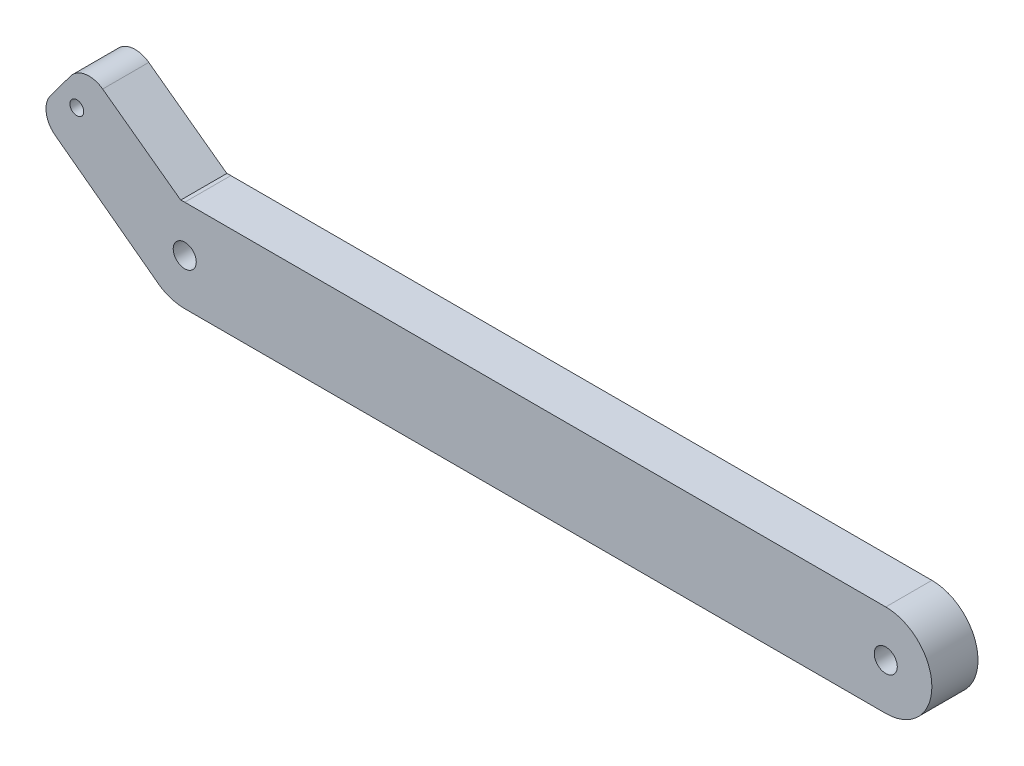
ISO-10303-21;
HEADER;
FILE_DESCRIPTION(('STEP AP214'),'2;1');
FILE_NAME('part.step','',(''),(''),'','','');
FILE_SCHEMA(('AUTOMOTIVE_DESIGN { 1 0 10303 214 1 1 1 1 }'));
ENDSEC;
DATA;
#1=APPLICATION_CONTEXT('core data for automotive mechanical design processes');
#2=APPLICATION_PROTOCOL_DEFINITION('international standard','automotive_design',2000,#1);
#3=PRODUCT_CONTEXT('',#1,'mechanical');
#4=PRODUCT('Part','Part','',(#3));
#5=PRODUCT_RELATED_PRODUCT_CATEGORY('part','',(#4));
#6=PRODUCT_DEFINITION_FORMATION('','',#4);
#7=PRODUCT_DEFINITION_CONTEXT('part definition',#1,'design');
#8=PRODUCT_DEFINITION('design','',#6,#7);
#9=PRODUCT_DEFINITION_SHAPE('','',#8);
#10=(LENGTH_UNIT() NAMED_UNIT(*) SI_UNIT(.MILLI.,.METRE.));
#11=(NAMED_UNIT(*) PLANE_ANGLE_UNIT() SI_UNIT($,.RADIAN.));
#12=(NAMED_UNIT(*) SI_UNIT($,.STERADIAN.) SOLID_ANGLE_UNIT());
#13=UNCERTAINTY_MEASURE_WITH_UNIT(LENGTH_MEASURE(1.E-05),#10,'distance_accuracy_value','');
#14=(GEOMETRIC_REPRESENTATION_CONTEXT(3) GLOBAL_UNCERTAINTY_ASSIGNED_CONTEXT((#13)) GLOBAL_UNIT_ASSIGNED_CONTEXT((#10,
#11,#12)) REPRESENTATION_CONTEXT('',''));
#15=CARTESIAN_POINT('',(0.,0.,0.));
#16=DIRECTION('',(0.,0.,1.));
#17=DIRECTION('',(1.,0.,0.));
#18=AXIS2_PLACEMENT_3D('',#15,#16,#17);
#19=CARTESIAN_POINT('',(0.,10.0000000000007,10.));
#20=DIRECTION('',(0.,0.,-1.));
#21=DIRECTION('',(-1.,0.,0.));
#22=AXIS2_PLACEMENT_3D('',#19,#20,#21);
#23=PLANE('',#22);
#24=CARTESIAN_POINT('',(0.,10.0000000000007,10.));
#25=DIRECTION('',(0.,0.,1.));
#26=DIRECTION('',(-1.,0.,0.));
#27=AXIS2_PLACEMENT_3D('',#24,#25,#26);
#28=CIRCLE('',#27,10.0000000000007);
#29=CARTESIAN_POINT('',(-5.30568368334004,1.52357854679586,10.));
#30=VERTEX_POINT('',#29);
#31=CARTESIAN_POINT('',(0.,0.,10.));
#32=VERTEX_POINT('',#31);
#33=EDGE_CURVE('E161',#30,#32,#28,.T.);
#34=ORIENTED_EDGE('',*,*,#33,.T.);
#35=DIRECTION('',(1.,0.,0.));
#36=VECTOR('',#35,1.);
#37=CARTESIAN_POINT('',(0.,0.,10.));
#38=LINE('',#37,#36);
#39=CARTESIAN_POINT('',(152.,0.,10.));
#40=VERTEX_POINT('',#39);
#41=EDGE_CURVE('E99',#32,#40,#38,.T.);
#42=ORIENTED_EDGE('',*,*,#41,.T.);
#43=CARTESIAN_POINT('',(152.,10.,10.));
#44=DIRECTION('',(0.,0.,1.));
#45=DIRECTION('',(-1.,0.,0.));
#46=AXIS2_PLACEMENT_3D('',#43,#44,#45);
#47=CIRCLE('',#46,10.);
#48=CARTESIAN_POINT('',(152.,20.,10.));
#49=VERTEX_POINT('',#48);
#50=EDGE_CURVE('E182',#40,#49,#47,.T.);
#51=ORIENTED_EDGE('',*,*,#50,.T.);
#52=DIRECTION('',(-1.,0.,0.));
#53=VECTOR('',#52,1.);
#54=CARTESIAN_POINT('',(0.,20.,10.));
#55=LINE('',#54,#53);
#56=CARTESIAN_POINT('',(0.,20.,10.));
#57=VERTEX_POINT('',#56);
#58=EDGE_CURVE('E201',#49,#57,#55,.T.);
#59=ORIENTED_EDGE('',*,*,#58,.T.);
#60=CARTESIAN_POINT('',(0.,10.0000000000007,10.));
#61=DIRECTION('',(0.,0.,1.));
#62=DIRECTION('',(1.,0.,0.));
#63=AXIS2_PLACEMENT_3D('',#60,#61,#62);
#64=CIRCLE('',#63,9.99999999999928);
#65=CARTESIAN_POINT('',(-0.876599726412103,19.961504551003,10.));
#66=VERTEX_POINT('',#65);
#67=EDGE_CURVE('E198',#57,#66,#64,.T.);
#68=ORIENTED_EDGE('',*,*,#67,.T.);
#69=DIRECTION('',(-0.806856744966036,0.590747148196936,0.));
#70=VECTOR('',#69,1.);
#71=CARTESIAN_POINT('',(-17.7993268257786,32.3516256425564,10.));
#72=LINE('',#71,#70);
#73=CARTESIAN_POINT('',(-17.7993268257786,32.3516256425564,10.));
#74=VERTEX_POINT('',#73);
#75=EDGE_CURVE('E200',#66,#74,#72,.T.);
#76=ORIENTED_EDGE('',*,*,#75,.T.);
#77=CARTESIAN_POINT('',(-20.7530625667633,28.3173419177262,10.));
#78=DIRECTION('',(0.,0.,1.));
#79=DIRECTION('',(1.,0.,0.));
#80=AXIS2_PLACEMENT_3D('',#77,#78,#79);
#81=CIRCLE('',#80,5.);
#82=CARTESIAN_POINT('',(-24.7625453028706,31.3046564624064,10.));
#83=VERTEX_POINT('',#82);
#84=EDGE_CURVE('E124',#74,#83,#81,.T.);
#85=ORIENTED_EDGE('',*,*,#84,.T.);
#86=DIRECTION('',(-0.59746290893604,-0.801896547221452,0.));
#87=VECTOR('',#86,1.);
#88=CARTESIAN_POINT('',(-29.098088918838,25.4856216671527,10.));
#89=LINE('',#88,#87);
#90=CARTESIAN_POINT('',(-29.098088918838,25.4856216671527,10.));
#91=VERTEX_POINT('',#90);
#92=EDGE_CURVE('E118',#83,#91,#89,.T.);
#93=ORIENTED_EDGE('',*,*,#92,.T.);
#94=CARTESIAN_POINT('',(-25.0886061827308,22.4983071224725,10.));
#95=DIRECTION('',(0.,0.,1.));
#96=DIRECTION('',(1.,0.,0.));
#97=AXIS2_PLACEMENT_3D('',#94,#95,#96);
#98=CIRCLE('',#97,5.);
#99=CARTESIAN_POINT('',(-28.075920727411,18.4888243863652,10.));
#100=VERTEX_POINT('',#99);
#101=EDGE_CURVE('E122',#91,#100,#98,.T.);
#102=ORIENTED_EDGE('',*,*,#101,.T.);
#103=DIRECTION('',(0.801896547221452,-0.59746290893604,0.));
#104=VECTOR('',#103,1.);
#105=CARTESIAN_POINT('',(-5.30568368334004,1.52357854679586,10.));
#106=LINE('',#105,#104);
#107=EDGE_CURVE('E50',#100,#30,#106,.T.);
#108=ORIENTED_EDGE('',*,*,#107,.T.);
#109=EDGE_LOOP('',(#34,#42,#51,#59,#68,#76,#85,#93,#102,#108));
#110=FACE_BOUND('',#109,.T.);
#111=CARTESIAN_POINT('',(0.,10.0000000000007,10.));
#112=DIRECTION('',(0.,0.,1.));
#113=DIRECTION('',(1.,0.,0.));
#114=AXIS2_PLACEMENT_3D('',#111,#112,#113);
#115=CIRCLE('',#114,2.49999999999979);
#116=CARTESIAN_POINT('',(2.49999999999979,10.0000000000007,10.));
#117=VERTEX_POINT('',#116);
#118=EDGE_CURVE('E146',#117,#117,#115,.T.);
#119=ORIENTED_EDGE('',*,*,#118,.F.);
#120=EDGE_LOOP('',(#119));
#121=FACE_BOUND('',#120,.T.);
#122=CARTESIAN_POINT('',(152.,10.,10.));
#123=DIRECTION('',(0.,0.,1.));
#124=DIRECTION('',(1.,0.,0.));
#125=AXIS2_PLACEMENT_3D('',#122,#123,#124);
#126=CIRCLE('',#125,2.5);
#127=CARTESIAN_POINT('',(154.5,10.,10.));
#128=VERTEX_POINT('',#127);
#129=EDGE_CURVE('E212',#128,#128,#126,.T.);
#130=ORIENTED_EDGE('',*,*,#129,.F.);
#131=EDGE_LOOP('',(#130));
#132=FACE_BOUND('',#131,.T.);
#133=CARTESIAN_POINT('',(-23.4097551919063,26.035431675397,10.));
#134=DIRECTION('',(0.,0.,1.));
#135=DIRECTION('',(1.,0.,0.));
#136=AXIS2_PLACEMENT_3D('',#133,#134,#135);
#137=CIRCLE('',#136,1.5);
#138=CARTESIAN_POINT('',(-21.9097551919063,26.035431675397,10.));
#139=VERTEX_POINT('',#138);
#140=EDGE_CURVE('E218',#139,#139,#137,.T.);
#141=ORIENTED_EDGE('',*,*,#140,.F.);
#142=EDGE_LOOP('',(#141));
#143=FACE_BOUND('',#142,.T.);
#144=ADVANCED_FACE('F33',(#110,#121,#132,#143),#23,.F.);
#145=CARTESIAN_POINT('',(0.,10.0000000000007,0.));
#146=DIRECTION('',(0.,0.,-1.));
#147=DIRECTION('',(-1.,0.,0.));
#148=AXIS2_PLACEMENT_3D('',#145,#146,#147);
#149=PLANE('',#148);
#150=CARTESIAN_POINT('',(152.,10.,0.));
#151=DIRECTION('',(0.,0.,1.));
#152=DIRECTION('',(1.,0.,0.));
#153=AXIS2_PLACEMENT_3D('',#150,#151,#152);
#154=CIRCLE('',#153,2.5);
#155=CARTESIAN_POINT('',(154.5,10.,0.));
#156=VERTEX_POINT('',#155);
#157=EDGE_CURVE('E215',#156,#156,#154,.T.);
#158=ORIENTED_EDGE('',*,*,#157,.T.);
#159=EDGE_LOOP('',(#158));
#160=FACE_BOUND('',#159,.T.);
#161=CARTESIAN_POINT('',(0.,10.0000000000007,0.));
#162=DIRECTION('',(0.,0.,1.));
#163=DIRECTION('',(-1.,0.,0.));
#164=AXIS2_PLACEMENT_3D('',#161,#162,#163);
#165=CIRCLE('',#164,10.0000000000007);
#166=CARTESIAN_POINT('',(-5.30568368334004,1.52357854679586,0.));
#167=VERTEX_POINT('',#166);
#168=CARTESIAN_POINT('',(0.,0.,0.));
#169=VERTEX_POINT('',#168);
#170=EDGE_CURVE('E142',#167,#169,#165,.T.);
#171=ORIENTED_EDGE('',*,*,#170,.F.);
#172=DIRECTION('',(0.801896547221452,-0.59746290893604,0.));
#173=VECTOR('',#172,1.);
#174=CARTESIAN_POINT('',(-5.30568368334004,1.52357854679586,0.));
#175=LINE('',#174,#173);
#176=CARTESIAN_POINT('',(-28.075920727411,18.4888243863652,0.));
#177=VERTEX_POINT('',#176);
#178=EDGE_CURVE('E91',#177,#167,#175,.T.);
#179=ORIENTED_EDGE('',*,*,#178,.F.);
#180=CARTESIAN_POINT('',(-25.0886061827308,22.4983071224725,0.));
#181=DIRECTION('',(0.,0.,1.));
#182=DIRECTION('',(1.,0.,0.));
#183=AXIS2_PLACEMENT_3D('',#180,#181,#182);
#184=CIRCLE('',#183,5.);
#185=CARTESIAN_POINT('',(-29.098088918838,25.4856216671527,0.));
#186=VERTEX_POINT('',#185);
#187=EDGE_CURVE('E85',#186,#177,#184,.T.);
#188=ORIENTED_EDGE('',*,*,#187,.F.);
#189=DIRECTION('',(-0.59746290893604,-0.801896547221452,0.));
#190=VECTOR('',#189,1.);
#191=CARTESIAN_POINT('',(-29.098088918838,25.4856216671527,0.));
#192=LINE('',#191,#190);
#193=CARTESIAN_POINT('',(-24.7625453028706,31.3046564624064,0.));
#194=VERTEX_POINT('',#193);
#195=EDGE_CURVE('E132',#194,#186,#192,.T.);
#196=ORIENTED_EDGE('',*,*,#195,.F.);
#197=CARTESIAN_POINT('',(-20.7530625667633,28.3173419177262,0.));
#198=DIRECTION('',(0.,0.,1.));
#199=DIRECTION('',(1.,0.,0.));
#200=AXIS2_PLACEMENT_3D('',#197,#198,#199);
#201=CIRCLE('',#200,5.);
#202=CARTESIAN_POINT('',(-17.7993268257786,32.3516256425564,0.));
#203=VERTEX_POINT('',#202);
#204=EDGE_CURVE('E156',#203,#194,#201,.T.);
#205=ORIENTED_EDGE('',*,*,#204,.F.);
#206=DIRECTION('',(-0.806856744966036,0.590747148196936,0.));
#207=VECTOR('',#206,1.);
#208=CARTESIAN_POINT('',(-17.7993268257786,32.3516256425564,0.));
#209=LINE('',#208,#207);
#210=CARTESIAN_POINT('',(-0.876599726412103,19.961504551003,0.));
#211=VERTEX_POINT('',#210);
#212=EDGE_CURVE('E154',#211,#203,#209,.T.);
#213=ORIENTED_EDGE('',*,*,#212,.F.);
#214=CARTESIAN_POINT('',(0.,10.0000000000007,0.));
#215=DIRECTION('',(0.,0.,1.));
#216=DIRECTION('',(1.,0.,0.));
#217=AXIS2_PLACEMENT_3D('',#214,#215,#216);
#218=CIRCLE('',#217,9.99999999999928);
#219=CARTESIAN_POINT('',(0.,20.,0.));
#220=VERTEX_POINT('',#219);
#221=EDGE_CURVE('E152',#220,#211,#218,.T.);
#222=ORIENTED_EDGE('',*,*,#221,.F.);
#223=DIRECTION('',(-1.,0.,0.));
#224=VECTOR('',#223,1.);
#225=CARTESIAN_POINT('',(0.,20.,0.));
#226=LINE('',#225,#224);
#227=CARTESIAN_POINT('',(152.,20.,0.));
#228=VERTEX_POINT('',#227);
#229=EDGE_CURVE('E150',#228,#220,#226,.T.);
#230=ORIENTED_EDGE('',*,*,#229,.F.);
#231=CARTESIAN_POINT('',(152.,10.,0.));
#232=DIRECTION('',(0.,0.,1.));
#233=DIRECTION('',(-1.,0.,0.));
#234=AXIS2_PLACEMENT_3D('',#231,#232,#233);
#235=CIRCLE('',#234,10.);
#236=CARTESIAN_POINT('',(152.,0.,0.));
#237=VERTEX_POINT('',#236);
#238=EDGE_CURVE('E148',#237,#228,#235,.T.);
#239=ORIENTED_EDGE('',*,*,#238,.F.);
#240=DIRECTION('',(1.,0.,0.));
#241=VECTOR('',#240,1.);
#242=CARTESIAN_POINT('',(0.,0.,0.));
#243=LINE('',#242,#241);
#244=EDGE_CURVE('E145',#169,#237,#243,.T.);
#245=ORIENTED_EDGE('',*,*,#244,.F.);
#246=EDGE_LOOP('',(#171,#179,#188,#196,#205,#213,#222,#230,#239,#245));
#247=FACE_BOUND('',#246,.T.);
#248=CARTESIAN_POINT('',(0.,10.0000000000007,0.));
#249=DIRECTION('',(0.,0.,1.));
#250=DIRECTION('',(1.,0.,0.));
#251=AXIS2_PLACEMENT_3D('',#248,#249,#250);
#252=CIRCLE('',#251,2.49999999999979);
#253=CARTESIAN_POINT('',(2.49999999999979,10.0000000000007,0.));
#254=VERTEX_POINT('',#253);
#255=EDGE_CURVE('E209',#254,#254,#252,.T.);
#256=ORIENTED_EDGE('',*,*,#255,.T.);
#257=EDGE_LOOP('',(#256));
#258=FACE_BOUND('',#257,.T.);
#259=CARTESIAN_POINT('',(-23.4097551919063,26.035431675397,0.));
#260=DIRECTION('',(0.,0.,1.));
#261=DIRECTION('',(1.,0.,0.));
#262=AXIS2_PLACEMENT_3D('',#259,#260,#261);
#263=CIRCLE('',#262,1.5);
#264=CARTESIAN_POINT('',(-21.9097551919063,26.035431675397,0.));
#265=VERTEX_POINT('',#264);
#266=EDGE_CURVE('E221',#265,#265,#263,.T.);
#267=ORIENTED_EDGE('',*,*,#266,.T.);
#268=EDGE_LOOP('',(#267));
#269=FACE_BOUND('',#268,.T.);
#270=ADVANCED_FACE('F186',(#160,#247,#258,#269),#149,.T.);
#271=CARTESIAN_POINT('',(0.,10.0000000000007,10.));
#272=DIRECTION('',(0.,0.,-1.));
#273=DIRECTION('',(-1.,0.,0.));
#274=AXIS2_PLACEMENT_3D('',#271,#272,#273);
#275=CYLINDRICAL_SURFACE('',#274,10.0000000000007);
#276=ORIENTED_EDGE('',*,*,#170,.T.);
#277=DIRECTION('',(0.,0.,-1.));
#278=VECTOR('',#277,1.);
#279=CARTESIAN_POINT('',(0.,0.,10.));
#280=LINE('',#279,#278);
#281=EDGE_CURVE('E11',#32,#169,#280,.T.);
#282=ORIENTED_EDGE('',*,*,#281,.F.);
#283=ORIENTED_EDGE('',*,*,#33,.F.);
#284=DIRECTION('',(0.,0.,-1.));
#285=VECTOR('',#284,1.);
#286=CARTESIAN_POINT('',(-5.30568368334004,1.52357854679586,10.));
#287=LINE('',#286,#285);
#288=EDGE_CURVE('E138',#30,#167,#287,.T.);
#289=ORIENTED_EDGE('',*,*,#288,.T.);
#290=EDGE_LOOP('',(#276,#282,#283,#289));
#291=FACE_BOUND('',#290,.T.);
#292=ADVANCED_FACE('F35',(#291),#275,.T.);
#293=CARTESIAN_POINT('',(0.,0.,10.));
#294=DIRECTION('',(0.,1.,0.));
#295=DIRECTION('',(0.,0.,1.));
#296=AXIS2_PLACEMENT_3D('',#293,#294,#295);
#297=PLANE('',#296);
#298=ORIENTED_EDGE('',*,*,#244,.T.);
#299=DIRECTION('',(0.,0.,-1.));
#300=VECTOR('',#299,1.);
#301=CARTESIAN_POINT('',(152.,0.,10.));
#302=LINE('',#301,#300);
#303=EDGE_CURVE('E42',#40,#237,#302,.T.);
#304=ORIENTED_EDGE('',*,*,#303,.F.);
#305=ORIENTED_EDGE('',*,*,#41,.F.);
#306=ORIENTED_EDGE('',*,*,#281,.T.);
#307=EDGE_LOOP('',(#298,#304,#305,#306));
#308=FACE_BOUND('',#307,.T.);
#309=ADVANCED_FACE('F261',(#308),#297,.F.);
#310=CARTESIAN_POINT('',(152.,10.,10.));
#311=DIRECTION('',(0.,0.,-1.));
#312=DIRECTION('',(-1.,0.,0.));
#313=AXIS2_PLACEMENT_3D('',#310,#311,#312);
#314=CYLINDRICAL_SURFACE('',#313,10.);
#315=ORIENTED_EDGE('',*,*,#238,.T.);
#316=DIRECTION('',(0.,0.,-1.));
#317=VECTOR('',#316,1.);
#318=CARTESIAN_POINT('',(152.,20.,10.));
#319=LINE('',#318,#317);
#320=EDGE_CURVE('E174',#49,#228,#319,.T.);
#321=ORIENTED_EDGE('',*,*,#320,.F.);
#322=ORIENTED_EDGE('',*,*,#50,.F.);
#323=ORIENTED_EDGE('',*,*,#303,.T.);
#324=EDGE_LOOP('',(#315,#321,#322,#323));
#325=FACE_BOUND('',#324,.T.);
#326=ADVANCED_FACE('F180',(#325),#314,.T.);
#327=CARTESIAN_POINT('',(0.,20.,10.));
#328=DIRECTION('',(0.,-1.,0.));
#329=DIRECTION('',(1.,0.,0.));
#330=AXIS2_PLACEMENT_3D('',#327,#328,#329);
#331=PLANE('',#330);
#332=ORIENTED_EDGE('',*,*,#229,.T.);
#333=DIRECTION('',(0.,0.,-1.));
#334=VECTOR('',#333,1.);
#335=CARTESIAN_POINT('',(0.,20.,10.));
#336=LINE('',#335,#334);
#337=EDGE_CURVE('E171',#57,#220,#336,.T.);
#338=ORIENTED_EDGE('',*,*,#337,.F.);
#339=ORIENTED_EDGE('',*,*,#58,.F.);
#340=ORIENTED_EDGE('',*,*,#320,.T.);
#341=EDGE_LOOP('',(#332,#338,#339,#340));
#342=FACE_BOUND('',#341,.T.);
#343=ADVANCED_FACE('F192',(#342),#331,.F.);
#344=CARTESIAN_POINT('',(0.,10.0000000000007,10.));
#345=DIRECTION('',(0.,0.,-1.));
#346=DIRECTION('',(-1.,0.,0.));
#347=AXIS2_PLACEMENT_3D('',#344,#345,#346);
#348=CYLINDRICAL_SURFACE('',#347,9.99999999999928);
#349=ORIENTED_EDGE('',*,*,#221,.T.);
#350=DIRECTION('',(0.,0.,-1.));
#351=VECTOR('',#350,1.);
#352=CARTESIAN_POINT('',(-0.876599726412103,19.961504551003,10.));
#353=LINE('',#352,#351);
#354=EDGE_CURVE('E168',#66,#211,#353,.T.);
#355=ORIENTED_EDGE('',*,*,#354,.F.);
#356=ORIENTED_EDGE('',*,*,#67,.F.);
#357=ORIENTED_EDGE('',*,*,#337,.T.);
#358=EDGE_LOOP('',(#349,#355,#356,#357));
#359=FACE_BOUND('',#358,.T.);
#360=ADVANCED_FACE('F196',(#359),#348,.T.);
#361=CARTESIAN_POINT('',(-17.7993268257786,32.3516256425564,10.));
#362=DIRECTION('',(-0.590747148196936,-0.806856744966036,0.));
#363=DIRECTION('',(0.806856744966036,-0.590747148196936,0.));
#364=AXIS2_PLACEMENT_3D('',#361,#362,#363);
#365=PLANE('',#364);
#366=ORIENTED_EDGE('',*,*,#212,.T.);
#367=DIRECTION('',(0.,0.,-1.));
#368=VECTOR('',#367,1.);
#369=CARTESIAN_POINT('',(-17.7993268257786,32.3516256425564,10.));
#370=LINE('',#369,#368);
#371=EDGE_CURVE('E165',#74,#203,#370,.T.);
#372=ORIENTED_EDGE('',*,*,#371,.F.);
#373=ORIENTED_EDGE('',*,*,#75,.F.);
#374=ORIENTED_EDGE('',*,*,#354,.T.);
#375=EDGE_LOOP('',(#366,#372,#373,#374));
#376=FACE_BOUND('',#375,.T.);
#377=ADVANCED_FACE('F251',(#376),#365,.F.);
#378=CARTESIAN_POINT('',(-20.7530625667633,28.3173419177262,10.));
#379=DIRECTION('',(0.,0.,-1.));
#380=DIRECTION('',(-1.,0.,0.));
#381=AXIS2_PLACEMENT_3D('',#378,#379,#380);
#382=CYLINDRICAL_SURFACE('',#381,5.);
#383=ORIENTED_EDGE('',*,*,#204,.T.);
#384=DIRECTION('',(0.,0.,-1.));
#385=VECTOR('',#384,1.);
#386=CARTESIAN_POINT('',(-24.7625453028706,31.3046564624064,10.));
#387=LINE('',#386,#385);
#388=EDGE_CURVE('E133',#83,#194,#387,.T.);
#389=ORIENTED_EDGE('',*,*,#388,.F.);
#390=ORIENTED_EDGE('',*,*,#84,.F.);
#391=ORIENTED_EDGE('',*,*,#371,.T.);
#392=EDGE_LOOP('',(#383,#389,#390,#391));
#393=FACE_BOUND('',#392,.T.);
#394=ADVANCED_FACE('F248',(#393),#382,.T.);
#395=CARTESIAN_POINT('',(-29.098088918838,25.4856216671527,10.));
#396=DIRECTION('',(0.801896547221452,-0.59746290893604,0.));
#397=DIRECTION('',(0.59746290893604,0.801896547221452,0.));
#398=AXIS2_PLACEMENT_3D('',#395,#396,#397);
#399=PLANE('',#398);
#400=ORIENTED_EDGE('',*,*,#195,.T.);
#401=DIRECTION('',(0.,0.,-1.));
#402=VECTOR('',#401,1.);
#403=CARTESIAN_POINT('',(-29.098088918838,25.4856216671527,10.));
#404=LINE('',#403,#402);
#405=EDGE_CURVE('E129',#91,#186,#404,.T.);
#406=ORIENTED_EDGE('',*,*,#405,.F.);
#407=ORIENTED_EDGE('',*,*,#92,.F.);
#408=ORIENTED_EDGE('',*,*,#388,.T.);
#409=EDGE_LOOP('',(#400,#406,#407,#408));
#410=FACE_BOUND('',#409,.T.);
#411=ADVANCED_FACE('F130',(#410),#399,.F.);
#412=CARTESIAN_POINT('',(-25.0886061827308,22.4983071224725,10.));
#413=DIRECTION('',(0.,0.,-1.));
#414=DIRECTION('',(-1.,0.,0.));
#415=AXIS2_PLACEMENT_3D('',#412,#413,#414);
#416=CYLINDRICAL_SURFACE('',#415,5.);
#417=ORIENTED_EDGE('',*,*,#187,.T.);
#418=DIRECTION('',(0.,0.,-1.));
#419=VECTOR('',#418,1.);
#420=CARTESIAN_POINT('',(-28.075920727411,18.4888243863652,10.));
#421=LINE('',#420,#419);
#422=EDGE_CURVE('E134',#100,#177,#421,.T.);
#423=ORIENTED_EDGE('',*,*,#422,.F.);
#424=ORIENTED_EDGE('',*,*,#101,.F.);
#425=ORIENTED_EDGE('',*,*,#405,.T.);
#426=EDGE_LOOP('',(#417,#423,#424,#425));
#427=FACE_BOUND('',#426,.T.);
#428=ADVANCED_FACE('F136',(#427),#416,.T.);
#429=CARTESIAN_POINT('',(-5.30568368334004,1.52357854679586,10.));
#430=DIRECTION('',(0.59746290893604,0.801896547221452,0.));
#431=DIRECTION('',(-0.801896547221452,0.59746290893604,0.));
#432=AXIS2_PLACEMENT_3D('',#429,#430,#431);
#433=PLANE('',#432);
#434=ORIENTED_EDGE('',*,*,#178,.T.);
#435=ORIENTED_EDGE('',*,*,#288,.F.);
#436=ORIENTED_EDGE('',*,*,#107,.F.);
#437=ORIENTED_EDGE('',*,*,#422,.T.);
#438=EDGE_LOOP('',(#434,#435,#436,#437));
#439=FACE_BOUND('',#438,.T.);
#440=ADVANCED_FACE('F241',(#439),#433,.F.);
#441=CARTESIAN_POINT('',(0.,10.0000000000007,10.));
#442=DIRECTION('',(0.,0.,-1.));
#443=DIRECTION('',(-1.,0.,0.));
#444=AXIS2_PLACEMENT_3D('',#441,#442,#443);
#445=CYLINDRICAL_SURFACE('',#444,2.49999999999979);
#446=ORIENTED_EDGE('',*,*,#118,.T.);
#447=EDGE_LOOP('',(#446));
#448=FACE_BOUND('',#447,.T.);
#449=ORIENTED_EDGE('',*,*,#255,.F.);
#450=EDGE_LOOP('',(#449));
#451=FACE_BOUND('',#450,.T.);
#452=ADVANCED_FACE('F238',(#448,#451),#445,.F.);
#453=CARTESIAN_POINT('',(152.,10.,10.));
#454=DIRECTION('',(0.,0.,-1.));
#455=DIRECTION('',(-1.,0.,0.));
#456=AXIS2_PLACEMENT_3D('',#453,#454,#455);
#457=CYLINDRICAL_SURFACE('',#456,2.5);
#458=ORIENTED_EDGE('',*,*,#129,.T.);
#459=EDGE_LOOP('',(#458));
#460=FACE_BOUND('',#459,.T.);
#461=ORIENTED_EDGE('',*,*,#157,.F.);
#462=EDGE_LOOP('',(#461));
#463=FACE_BOUND('',#462,.T.);
#464=ADVANCED_FACE('F337',(#460,#463),#457,.F.);
#465=CARTESIAN_POINT('',(-23.4097551919063,26.035431675397,10.));
#466=DIRECTION('',(0.,0.,-1.));
#467=DIRECTION('',(-1.,0.,0.));
#468=AXIS2_PLACEMENT_3D('',#465,#466,#467);
#469=CYLINDRICAL_SURFACE('',#468,1.5);
#470=ORIENTED_EDGE('',*,*,#140,.T.);
#471=EDGE_LOOP('',(#470));
#472=FACE_BOUND('',#471,.T.);
#473=ORIENTED_EDGE('',*,*,#266,.F.);
#474=EDGE_LOOP('',(#473));
#475=FACE_BOUND('',#474,.T.);
#476=ADVANCED_FACE('F227',(#472,#475),#469,.F.);
#477=CLOSED_SHELL('',(#144,#270,#292,#309,#326,#343,#360,#377,#394,#411,#428,#440,#452,#464,#476));
#478=MANIFOLD_SOLID_BREP('B2',#477);
#479=ADVANCED_BREP_SHAPE_REPRESENTATION('',(#18,#478),#14);
#480=SHAPE_DEFINITION_REPRESENTATION(#9,#479);
ENDSEC;
END-ISO-10303-21;
